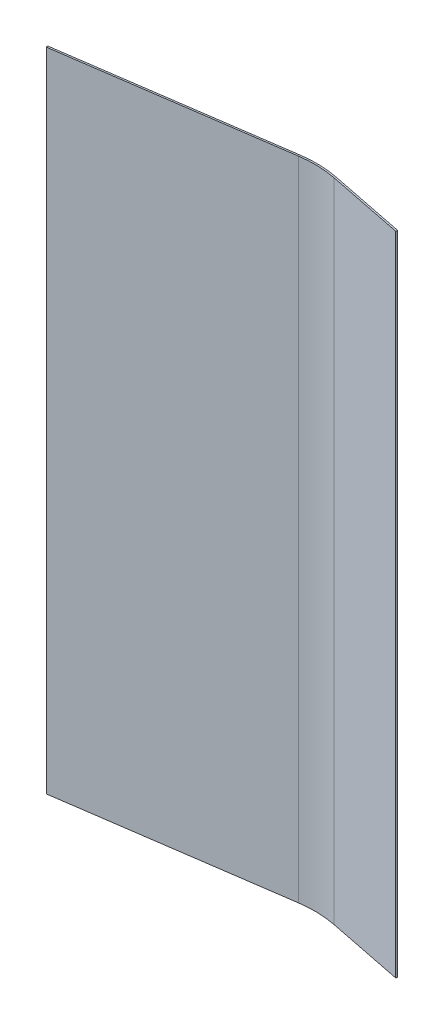
ISO-10303-21;
HEADER;
FILE_DESCRIPTION(('STEP AP214'),'2;1');
FILE_NAME('part.step','',(''),(''),'','','');
FILE_SCHEMA(('AUTOMOTIVE_DESIGN { 1 0 10303 214 1 1 1 1 }'));
ENDSEC;
DATA;
#1=APPLICATION_CONTEXT('core data for automotive mechanical design processes');
#2=APPLICATION_PROTOCOL_DEFINITION('international standard','automotive_design',2000,#1);
#3=PRODUCT_CONTEXT('',#1,'mechanical');
#4=PRODUCT('Part','Part','',(#3));
#5=PRODUCT_RELATED_PRODUCT_CATEGORY('part','',(#4));
#6=PRODUCT_DEFINITION_FORMATION('','',#4);
#7=PRODUCT_DEFINITION_CONTEXT('part definition',#1,'design');
#8=PRODUCT_DEFINITION('design','',#6,#7);
#9=PRODUCT_DEFINITION_SHAPE('','',#8);
#10=(LENGTH_UNIT() NAMED_UNIT(*) SI_UNIT(.MILLI.,.METRE.));
#11=(NAMED_UNIT(*) PLANE_ANGLE_UNIT() SI_UNIT($,.RADIAN.));
#12=(NAMED_UNIT(*) SI_UNIT($,.STERADIAN.) SOLID_ANGLE_UNIT());
#13=UNCERTAINTY_MEASURE_WITH_UNIT(LENGTH_MEASURE(1.E-05),#10,'distance_accuracy_value','');
#14=(GEOMETRIC_REPRESENTATION_CONTEXT(3) GLOBAL_UNCERTAINTY_ASSIGNED_CONTEXT((#13)) GLOBAL_UNIT_ASSIGNED_CONTEXT((#10,
#11,#12)) REPRESENTATION_CONTEXT('',''));
#15=CARTESIAN_POINT('',(0.,0.,0.));
#16=DIRECTION('',(0.,0.,1.));
#17=DIRECTION('',(1.,0.,0.));
#18=AXIS2_PLACEMENT_3D('',#15,#16,#17);
#19=CARTESIAN_POINT('',(-0.226121765947016,609.6,-1.57131320778672));
#20=DIRECTION('',(0.989803595456204,0.,-0.14243890768316));
#21=DIRECTION('',(-0.14243890768316,0.,-0.989803595456204));
#22=AXIS2_PLACEMENT_3D('',#19,#20,#21);
#23=PLANE('',#22);
#24=DIRECTION('',(0.14243890768316,0.,0.989803595456204));
#25=VECTOR('',#24,1.);
#26=CARTESIAN_POINT('',(-0.226121765947016,0.,-1.57131320778672));
#27=LINE('',#26,#25);
#28=CARTESIAN_POINT('',(-0.226121765947016,0.,-1.57131320778672));
#29=VERTEX_POINT('',#28);
#30=CARTESIAN_POINT('',(0.,0.,0.));
#31=VERTEX_POINT('',#30);
#32=EDGE_CURVE('E132',#29,#31,#27,.T.);
#33=ORIENTED_EDGE('',*,*,#32,.T.);
#34=DIRECTION('',(0.,-1.,0.));
#35=VECTOR('',#34,1.);
#36=CARTESIAN_POINT('',(0.,609.6,0.));
#37=LINE('',#36,#35);
#38=CARTESIAN_POINT('',(0.,609.6,0.));
#39=VERTEX_POINT('',#38);
#40=EDGE_CURVE('E113',#39,#31,#37,.T.);
#41=ORIENTED_EDGE('',*,*,#40,.F.);
#42=DIRECTION('',(0.14243890768316,0.,0.989803595456204));
#43=VECTOR('',#42,1.);
#44=CARTESIAN_POINT('',(-0.226121765947016,609.6,-1.57131320778672));
#45=LINE('',#44,#43);
#46=CARTESIAN_POINT('',(-0.226121765947016,609.6,-1.57131320778672));
#47=VERTEX_POINT('',#46);
#48=EDGE_CURVE('E120',#47,#39,#45,.T.);
#49=ORIENTED_EDGE('',*,*,#48,.F.);
#50=DIRECTION('',(0.,-1.,0.));
#51=VECTOR('',#50,1.);
#52=CARTESIAN_POINT('',(-0.226121765947016,609.6,-1.57131320778672));
#53=LINE('',#52,#51);
#54=EDGE_CURVE('E171',#47,#29,#53,.T.);
#55=ORIENTED_EDGE('',*,*,#54,.T.);
#56=EDGE_LOOP('',(#33,#41,#49,#55));
#57=FACE_BOUND('',#56,.T.);
#58=ADVANCED_FACE('F42',(#57),#23,.F.);
#59=CARTESIAN_POINT('',(0.,609.6,0.));
#60=DIRECTION('',(-0.14243890768316,0.,-0.989803595456204));
#61=DIRECTION('',(-0.989803595456204,0.,0.14243890768316));
#62=AXIS2_PLACEMENT_3D('',#59,#60,#61);
#63=PLANE('',#62);
#64=DIRECTION('',(0.989803595456204,0.,-0.14243890768316));
#65=VECTOR('',#64,1.);
#66=CARTESIAN_POINT('',(0.,0.,0.));
#67=LINE('',#66,#65);
#68=CARTESIAN_POINT('',(207.821540636552,0.,-29.9068152279829));
#69=VERTEX_POINT('',#68);
#70=EDGE_CURVE('E152',#31,#69,#67,.T.);
#71=ORIENTED_EDGE('',*,*,#70,.T.);
#72=DIRECTION('',(0.,-1.,0.));
#73=VECTOR('',#72,1.);
#74=CARTESIAN_POINT('',(207.821540636552,609.6,-29.9068152279829));
#75=LINE('',#74,#73);
#76=CARTESIAN_POINT('',(207.821540636552,609.6,-29.9068152279829));
#77=VERTEX_POINT('',#76);
#78=EDGE_CURVE('E116',#69,#77,#75,.F.);
#79=ORIENTED_EDGE('',*,*,#78,.T.);
#80=DIRECTION('',(0.989803595456204,0.,-0.14243890768316));
#81=VECTOR('',#80,1.);
#82=CARTESIAN_POINT('',(0.,609.6,0.));
#83=LINE('',#82,#81);
#84=EDGE_CURVE('E108',#39,#77,#83,.T.);
#85=ORIENTED_EDGE('',*,*,#84,.F.);
#86=ORIENTED_EDGE('',*,*,#40,.T.);
#87=EDGE_LOOP('',(#71,#79,#85,#86));
#88=FACE_BOUND('',#87,.T.);
#89=ADVANCED_FACE('F111',(#88),#63,.F.);
#90=CARTESIAN_POINT('',(225.091665708226,609.6,-32.3920938853382));
#91=DIRECTION('',(0.195946144242518,0.,-0.980614658546613));
#92=DIRECTION('',(-0.980614658546613,0.,-0.195946144242518));
#93=AXIS2_PLACEMENT_3D('',#90,#91,#92);
#94=PLANE('',#93);
#95=DIRECTION('',(0.980614658546613,0.,0.195946144242518));
#96=VECTOR('',#95,1.);
#97=CARTESIAN_POINT('',(225.091665708226,609.6,-32.3920938853382));
#98=LINE('',#97,#96);
#99=CARTESIAN_POINT('',(242.2014619122,609.6,-28.9732192379685));
#100=VERTEX_POINT('',#99);
#101=CARTESIAN_POINT('',(314.955840223112,609.6,-14.4354599024986));
#102=VERTEX_POINT('',#101);
#103=EDGE_CURVE('E119',#100,#102,#98,.T.);
#104=ORIENTED_EDGE('',*,*,#103,.F.);
#105=DIRECTION('',(0.,-1.,0.));
#106=VECTOR('',#105,1.);
#107=CARTESIAN_POINT('',(242.2014619122,0.,-28.9732192379685));
#108=LINE('',#107,#106);
#109=CARTESIAN_POINT('',(242.2014619122,0.,-28.9732192379685));
#110=VERTEX_POINT('',#109);
#111=EDGE_CURVE('E133',#100,#110,#108,.T.);
#112=ORIENTED_EDGE('',*,*,#111,.T.);
#113=DIRECTION('',(0.980614658546613,0.,0.195946144242518));
#114=VECTOR('',#113,1.);
#115=CARTESIAN_POINT('',(225.091665708226,0.,-32.3920938853382));
#116=LINE('',#115,#114);
#117=CARTESIAN_POINT('',(314.955840223112,0.,-14.4354599024986));
#118=VERTEX_POINT('',#117);
#119=EDGE_CURVE('E154',#110,#118,#116,.T.);
#120=ORIENTED_EDGE('',*,*,#119,.T.);
#121=DIRECTION('',(0.,-1.,0.));
#122=VECTOR('',#121,1.);
#123=CARTESIAN_POINT('',(314.955840223112,609.6,-14.4354599024986));
#124=LINE('',#123,#122);
#125=EDGE_CURVE('E134',#102,#118,#124,.T.);
#126=ORIENTED_EDGE('',*,*,#125,.F.);
#127=EDGE_LOOP('',(#104,#112,#120,#126));
#128=FACE_BOUND('',#127,.T.);
#129=ADVANCED_FACE('F162',(#128),#94,.F.);
#130=CARTESIAN_POINT('',(315.266904727097,609.6,-15.9921856729414));
#131=DIRECTION('',(-0.980614658546614,0.,-0.195946144242514));
#132=DIRECTION('',(-0.195946144242514,0.,0.980614658546614));
#133=AXIS2_PLACEMENT_3D('',#130,#131,#132);
#134=PLANE('',#133);
#135=DIRECTION('',(0.195946144242514,0.,-0.980614658546614));
#136=VECTOR('',#135,1.);
#137=CARTESIAN_POINT('',(315.266904727097,0.,-15.9921856729414));
#138=LINE('',#137,#136);
#139=CARTESIAN_POINT('',(315.266904727097,0.,-15.9921856729414));
#140=VERTEX_POINT('',#139);
#141=EDGE_CURVE('E174',#118,#140,#138,.T.);
#142=ORIENTED_EDGE('',*,*,#141,.T.);
#143=DIRECTION('',(0.,-1.,0.));
#144=VECTOR('',#143,1.);
#145=CARTESIAN_POINT('',(315.266904727097,609.6,-15.9921856729414));
#146=LINE('',#145,#144);
#147=CARTESIAN_POINT('',(315.266904727097,609.6,-15.9921856729414));
#148=VERTEX_POINT('',#147);
#149=EDGE_CURVE('E139',#148,#140,#146,.T.);
#150=ORIENTED_EDGE('',*,*,#149,.F.);
#151=DIRECTION('',(0.195946144242514,0.,-0.980614658546614));
#152=VECTOR('',#151,1.);
#153=CARTESIAN_POINT('',(315.266904727097,609.6,-15.9921856729414));
#154=LINE('',#153,#152);
#155=EDGE_CURVE('E164',#102,#148,#154,.T.);
#156=ORIENTED_EDGE('',*,*,#155,.F.);
#157=ORIENTED_EDGE('',*,*,#125,.T.);
#158=EDGE_LOOP('',(#142,#150,#156,#157));
#159=FACE_BOUND('',#158,.T.);
#160=ADVANCED_FACE('F183',(#159),#134,.F.);
#161=CARTESIAN_POINT('',(225.135389646524,609.6,-34.0022395721461));
#162=DIRECTION('',(-0.195946144242518,0.,0.980614658546613));
#163=DIRECTION('',(0.980614658546613,0.,0.195946144242518));
#164=AXIS2_PLACEMENT_3D('',#161,#162,#163);
#165=PLANE('',#164);
#166=DIRECTION('',(-0.980614658546613,0.,-0.195946144242518));
#167=VECTOR('',#166,1.);
#168=CARTESIAN_POINT('',(225.135389646524,0.,-34.0022395721461));
#169=LINE('',#168,#167);
#170=CARTESIAN_POINT('',(242.245185850498,0.,-30.5833649247764));
#171=VERTEX_POINT('',#170);
#172=EDGE_CURVE('E176',#140,#171,#169,.T.);
#173=ORIENTED_EDGE('',*,*,#172,.T.);
#174=DIRECTION('',(0.,-1.,0.));
#175=VECTOR('',#174,1.);
#176=CARTESIAN_POINT('',(242.245185850498,609.6,-30.5833649247764));
#177=LINE('',#176,#175);
#178=CARTESIAN_POINT('',(242.245185850498,609.6,-30.5833649247764));
#179=VERTEX_POINT('',#178);
#180=EDGE_CURVE('E57',#171,#179,#177,.F.);
#181=ORIENTED_EDGE('',*,*,#180,.T.);
#182=DIRECTION('',(-0.980614658546613,0.,-0.195946144242518));
#183=VECTOR('',#182,1.);
#184=CARTESIAN_POINT('',(225.135389646524,609.6,-34.0022395721461));
#185=LINE('',#184,#183);
#186=EDGE_CURVE('E166',#148,#179,#185,.T.);
#187=ORIENTED_EDGE('',*,*,#186,.F.);
#188=ORIENTED_EDGE('',*,*,#149,.T.);
#189=EDGE_LOOP('',(#173,#181,#187,#188));
#190=FACE_BOUND('',#189,.T.);
#191=ADVANCED_FACE('F181',(#190),#165,.F.);
#192=CARTESIAN_POINT('',(-0.226121765947016,609.6,-1.57131320778672));
#193=DIRECTION('',(0.14243890768316,0.,0.989803595456204));
#194=DIRECTION('',(0.989803595456204,0.,-0.14243890768316));
#195=AXIS2_PLACEMENT_3D('',#192,#193,#194);
#196=PLANE('',#195);
#197=DIRECTION('',(-0.989803595456204,0.,0.14243890768316));
#198=VECTOR('',#197,1.);
#199=CARTESIAN_POINT('',(-0.226121765947016,609.6,-1.57131320778672));
#200=LINE('',#199,#198);
#201=CARTESIAN_POINT('',(207.865264574849,609.6,-31.5169609147908));
#202=VERTEX_POINT('',#201);
#203=EDGE_CURVE('E125',#202,#47,#200,.T.);
#204=ORIENTED_EDGE('',*,*,#203,.F.);
#205=DIRECTION('',(0.,-1.,0.));
#206=VECTOR('',#205,1.);
#207=CARTESIAN_POINT('',(207.865264574849,609.6,-31.5169609147908));
#208=LINE('',#207,#206);
#209=CARTESIAN_POINT('',(207.865264574849,0.,-31.5169609147908));
#210=VERTEX_POINT('',#209);
#211=EDGE_CURVE('E144',#202,#210,#208,.T.);
#212=ORIENTED_EDGE('',*,*,#211,.T.);
#213=DIRECTION('',(-0.989803595456204,0.,0.14243890768316));
#214=VECTOR('',#213,1.);
#215=CARTESIAN_POINT('',(-0.226121765947016,0.,-1.57131320778672));
#216=LINE('',#215,#214);
#217=EDGE_CURVE('E129',#210,#29,#216,.T.);
#218=ORIENTED_EDGE('',*,*,#217,.T.);
#219=ORIENTED_EDGE('',*,*,#54,.F.);
#220=EDGE_LOOP('',(#204,#212,#218,#219));
#221=FACE_BOUND('',#220,.T.);
#222=ADVANCED_FACE('F188',(#221),#196,.F.);
#223=CARTESIAN_POINT('',(0.,609.6,0.));
#224=DIRECTION('',(0.,1.,0.));
#225=DIRECTION('',(0.,0.,1.));
#226=AXIS2_PLACEMENT_3D('',#223,#224,#225);
#227=PLANE('',#226);
#228=ORIENTED_EDGE('',*,*,#186,.T.);
#229=CARTESIAN_POINT('',(222.337057595458,609.6,69.0470843835595));
#230=DIRECTION('',(0.,1.,0.));
#231=DIRECTION('',(0.,0.,1.));
#232=AXIS2_PLACEMENT_3D('',#229,#230,#231);
#233=CIRCLE('',#232,101.6);
#234=EDGE_CURVE('E149',#179,#202,#233,.T.);
#235=ORIENTED_EDGE('',*,*,#234,.T.);
#236=ORIENTED_EDGE('',*,*,#203,.T.);
#237=ORIENTED_EDGE('',*,*,#48,.T.);
#238=ORIENTED_EDGE('',*,*,#84,.T.);
#239=CARTESIAN_POINT('',(222.293333657161,609.6,70.6572300703674));
#240=DIRECTION('',(0.,1.,0.));
#241=DIRECTION('',(0.,0.,1.));
#242=AXIS2_PLACEMENT_3D('',#239,#240,#241);
#243=CIRCLE('',#242,101.6);
#244=EDGE_CURVE('E11',#77,#100,#243,.F.);
#245=ORIENTED_EDGE('',*,*,#244,.T.);
#246=ORIENTED_EDGE('',*,*,#103,.T.);
#247=ORIENTED_EDGE('',*,*,#155,.T.);
#248=EDGE_LOOP('',(#228,#235,#236,#237,#238,#245,#246,#247));
#249=FACE_BOUND('',#248,.T.);
#250=ADVANCED_FACE('F123',(#249),#227,.T.);
#251=CARTESIAN_POINT('',(0.,0.,0.));
#252=DIRECTION('',(0.,1.,0.));
#253=DIRECTION('',(0.,0.,1.));
#254=AXIS2_PLACEMENT_3D('',#251,#252,#253);
#255=PLANE('',#254);
#256=ORIENTED_EDGE('',*,*,#217,.F.);
#257=CARTESIAN_POINT('',(222.337057595458,0.,69.0470843835595));
#258=DIRECTION('',(0.,1.,0.));
#259=DIRECTION('',(0.,0.,1.));
#260=AXIS2_PLACEMENT_3D('',#257,#258,#259);
#261=CIRCLE('',#260,101.6);
#262=EDGE_CURVE('E65',#210,#171,#261,.F.);
#263=ORIENTED_EDGE('',*,*,#262,.T.);
#264=ORIENTED_EDGE('',*,*,#172,.F.);
#265=ORIENTED_EDGE('',*,*,#141,.F.);
#266=ORIENTED_EDGE('',*,*,#119,.F.);
#267=CARTESIAN_POINT('',(222.293333657161,0.,70.6572300703674));
#268=DIRECTION('',(0.,1.,0.));
#269=DIRECTION('',(0.,0.,1.));
#270=AXIS2_PLACEMENT_3D('',#267,#268,#269);
#271=CIRCLE('',#270,101.6);
#272=EDGE_CURVE('E50',#110,#69,#271,.T.);
#273=ORIENTED_EDGE('',*,*,#272,.T.);
#274=ORIENTED_EDGE('',*,*,#70,.F.);
#275=ORIENTED_EDGE('',*,*,#32,.F.);
#276=EDGE_LOOP('',(#256,#263,#264,#265,#266,#273,#274,#275));
#277=FACE_BOUND('',#276,.T.);
#278=ADVANCED_FACE('F151',(#277),#255,.F.);
#279=CARTESIAN_POINT('',(222.293333657161,609.6,70.6572300703674));
#280=DIRECTION('',(0.,1.,0.));
#281=DIRECTION('',(0.,0.,1.));
#282=AXIS2_PLACEMENT_3D('',#279,#280,#281);
#283=CYLINDRICAL_SURFACE('',#282,101.6);
#284=ORIENTED_EDGE('',*,*,#244,.F.);
#285=ORIENTED_EDGE('',*,*,#78,.F.);
#286=ORIENTED_EDGE('',*,*,#272,.F.);
#287=ORIENTED_EDGE('',*,*,#111,.F.);
#288=EDGE_LOOP('',(#284,#285,#286,#287));
#289=FACE_BOUND('',#288,.T.);
#290=ADVANCED_FACE('F158',(#289),#283,.F.);
#291=CARTESIAN_POINT('',(222.337057595458,609.6,69.0470843835595));
#292=DIRECTION('',(0.,-1.,0.));
#293=DIRECTION('',(0.,0.,-1.));
#294=AXIS2_PLACEMENT_3D('',#291,#292,#293);
#295=CYLINDRICAL_SURFACE('',#294,101.6);
#296=ORIENTED_EDGE('',*,*,#234,.F.);
#297=ORIENTED_EDGE('',*,*,#180,.F.);
#298=ORIENTED_EDGE('',*,*,#262,.F.);
#299=ORIENTED_EDGE('',*,*,#211,.F.);
#300=EDGE_LOOP('',(#296,#297,#298,#299));
#301=FACE_BOUND('',#300,.T.);
#302=ADVANCED_FACE('F44',(#301),#295,.T.);
#303=CLOSED_SHELL('',(#58,#89,#129,#160,#191,#222,#250,#278,#290,#302));
#304=MANIFOLD_SOLID_BREP('B2',#303);
#305=ADVANCED_BREP_SHAPE_REPRESENTATION('',(#18,#304),#14);
#306=SHAPE_DEFINITION_REPRESENTATION(#9,#305);
ENDSEC;
END-ISO-10303-21;
